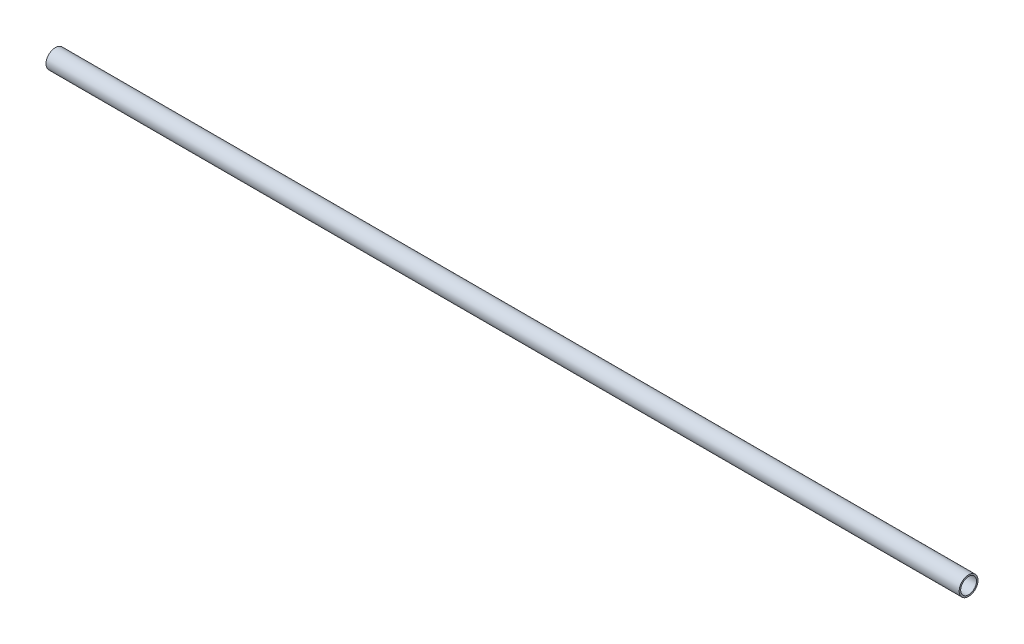
ISO-10303-21;
HEADER;
FILE_DESCRIPTION(('STEP AP214'),'2;1');
FILE_NAME('part.step','',(''),(''),'','','');
FILE_SCHEMA(('AUTOMOTIVE_DESIGN { 1 0 10303 214 1 1 1 1 }'));
ENDSEC;
DATA;
#1=APPLICATION_CONTEXT('core data for automotive mechanical design processes');
#2=APPLICATION_PROTOCOL_DEFINITION('international standard','automotive_design',2000,#1);
#3=PRODUCT_CONTEXT('',#1,'mechanical');
#4=PRODUCT('Part','Part','',(#3));
#5=PRODUCT_RELATED_PRODUCT_CATEGORY('part','',(#4));
#6=PRODUCT_DEFINITION_FORMATION('','',#4);
#7=PRODUCT_DEFINITION_CONTEXT('part definition',#1,'design');
#8=PRODUCT_DEFINITION('design','',#6,#7);
#9=PRODUCT_DEFINITION_SHAPE('','',#8);
#10=(LENGTH_UNIT() NAMED_UNIT(*) SI_UNIT(.MILLI.,.METRE.));
#11=(NAMED_UNIT(*) PLANE_ANGLE_UNIT() SI_UNIT($,.RADIAN.));
#12=(NAMED_UNIT(*) SI_UNIT($,.STERADIAN.) SOLID_ANGLE_UNIT());
#13=UNCERTAINTY_MEASURE_WITH_UNIT(LENGTH_MEASURE(1.E-05),#10,'distance_accuracy_value','');
#14=(GEOMETRIC_REPRESENTATION_CONTEXT(3) GLOBAL_UNCERTAINTY_ASSIGNED_CONTEXT((#13)) GLOBAL_UNIT_ASSIGNED_CONTEXT((#10,
#11,#12)) REPRESENTATION_CONTEXT('',''));
#15=CARTESIAN_POINT('',(0.,0.,0.));
#16=DIRECTION('',(0.,0.,1.));
#17=DIRECTION('',(1.,0.,0.));
#18=AXIS2_PLACEMENT_3D('',#15,#16,#17);
#19=CARTESIAN_POINT('',(-307.975,0.,0.));
#20=DIRECTION('',(1.,0.,0.));
#21=DIRECTION('',(0.,0.,-1.));
#22=AXIS2_PLACEMENT_3D('',#19,#20,#21);
#23=CYLINDRICAL_SURFACE('',#22,3.175);
#24=CARTESIAN_POINT('',(-307.975,0.,0.));
#25=DIRECTION('',(1.,0.,0.));
#26=DIRECTION('',(0.,0.,-1.));
#27=AXIS2_PLACEMENT_3D('',#24,#25,#26);
#28=CIRCLE('',#27,3.175);
#29=CARTESIAN_POINT('',(-307.975,0.,-3.175));
#30=VERTEX_POINT('',#29);
#31=EDGE_CURVE('E10',#30,#30,#28,.T.);
#32=ORIENTED_EDGE('',*,*,#31,.T.);
#33=EDGE_LOOP('',(#32));
#34=FACE_BOUND('',#33,.T.);
#35=CARTESIAN_POINT('',(0.,0.,0.));
#36=DIRECTION('',(1.,0.,0.));
#37=DIRECTION('',(0.,0.,-1.));
#38=AXIS2_PLACEMENT_3D('',#35,#36,#37);
#39=CIRCLE('',#38,3.175);
#40=CARTESIAN_POINT('',(0.,0.,-3.175));
#41=VERTEX_POINT('',#40);
#42=EDGE_CURVE('E37',#41,#41,#39,.T.);
#43=ORIENTED_EDGE('',*,*,#42,.F.);
#44=EDGE_LOOP('',(#43));
#45=FACE_BOUND('',#44,.T.);
#46=ADVANCED_FACE('F34',(#34,#45),#23,.T.);
#47=CARTESIAN_POINT('',(-307.975,0.,0.));
#48=DIRECTION('',(1.,0.,0.));
#49=DIRECTION('',(0.,0.,-1.));
#50=AXIS2_PLACEMENT_3D('',#47,#48,#49);
#51=PLANE('',#50);
#52=CARTESIAN_POINT('',(-307.975,0.,0.));
#53=DIRECTION('',(1.,0.,0.));
#54=DIRECTION('',(0.,0.,-1.));
#55=AXIS2_PLACEMENT_3D('',#52,#53,#54);
#56=CIRCLE('',#55,2.667);
#57=CARTESIAN_POINT('',(-307.975,0.,-2.667));
#58=VERTEX_POINT('',#57);
#59=EDGE_CURVE('E44',#58,#58,#56,.T.);
#60=ORIENTED_EDGE('',*,*,#59,.T.);
#61=EDGE_LOOP('',(#60));
#62=FACE_BOUND('',#61,.T.);
#63=ORIENTED_EDGE('',*,*,#31,.F.);
#64=EDGE_LOOP('',(#63));
#65=FACE_BOUND('',#64,.T.);
#66=ADVANCED_FACE('F52',(#62,#65),#51,.F.);
#67=CARTESIAN_POINT('',(0.,0.,0.));
#68=DIRECTION('',(1.,0.,0.));
#69=DIRECTION('',(0.,0.,-1.));
#70=AXIS2_PLACEMENT_3D('',#67,#68,#69);
#71=PLANE('',#70);
#72=CARTESIAN_POINT('',(0.,0.,0.));
#73=DIRECTION('',(1.,0.,0.));
#74=DIRECTION('',(0.,0.,-1.));
#75=AXIS2_PLACEMENT_3D('',#72,#73,#74);
#76=CIRCLE('',#75,2.667);
#77=CARTESIAN_POINT('',(0.,0.,-2.667));
#78=VERTEX_POINT('',#77);
#79=EDGE_CURVE('E46',#78,#78,#76,.T.);
#80=ORIENTED_EDGE('',*,*,#79,.F.);
#81=EDGE_LOOP('',(#80));
#82=FACE_BOUND('',#81,.T.);
#83=ORIENTED_EDGE('',*,*,#42,.T.);
#84=EDGE_LOOP('',(#83));
#85=FACE_BOUND('',#84,.T.);
#86=ADVANCED_FACE('F58',(#82,#85),#71,.T.);
#87=CARTESIAN_POINT('',(-307.975,0.,0.));
#88=DIRECTION('',(1.,0.,0.));
#89=DIRECTION('',(0.,0.,-1.));
#90=AXIS2_PLACEMENT_3D('',#87,#88,#89);
#91=CYLINDRICAL_SURFACE('',#90,2.667);
#92=ORIENTED_EDGE('',*,*,#59,.F.);
#93=EDGE_LOOP('',(#92));
#94=FACE_BOUND('',#93,.T.);
#95=ORIENTED_EDGE('',*,*,#79,.T.);
#96=EDGE_LOOP('',(#95));
#97=FACE_BOUND('',#96,.T.);
#98=ADVANCED_FACE('F55',(#94,#97),#91,.F.);
#99=CLOSED_SHELL('',(#46,#66,#86,#98));
#100=MANIFOLD_SOLID_BREP('B2',#99);
#101=ADVANCED_BREP_SHAPE_REPRESENTATION('',(#18,#100),#14);
#102=SHAPE_DEFINITION_REPRESENTATION(#9,#101);
ENDSEC;
END-ISO-10303-21;
